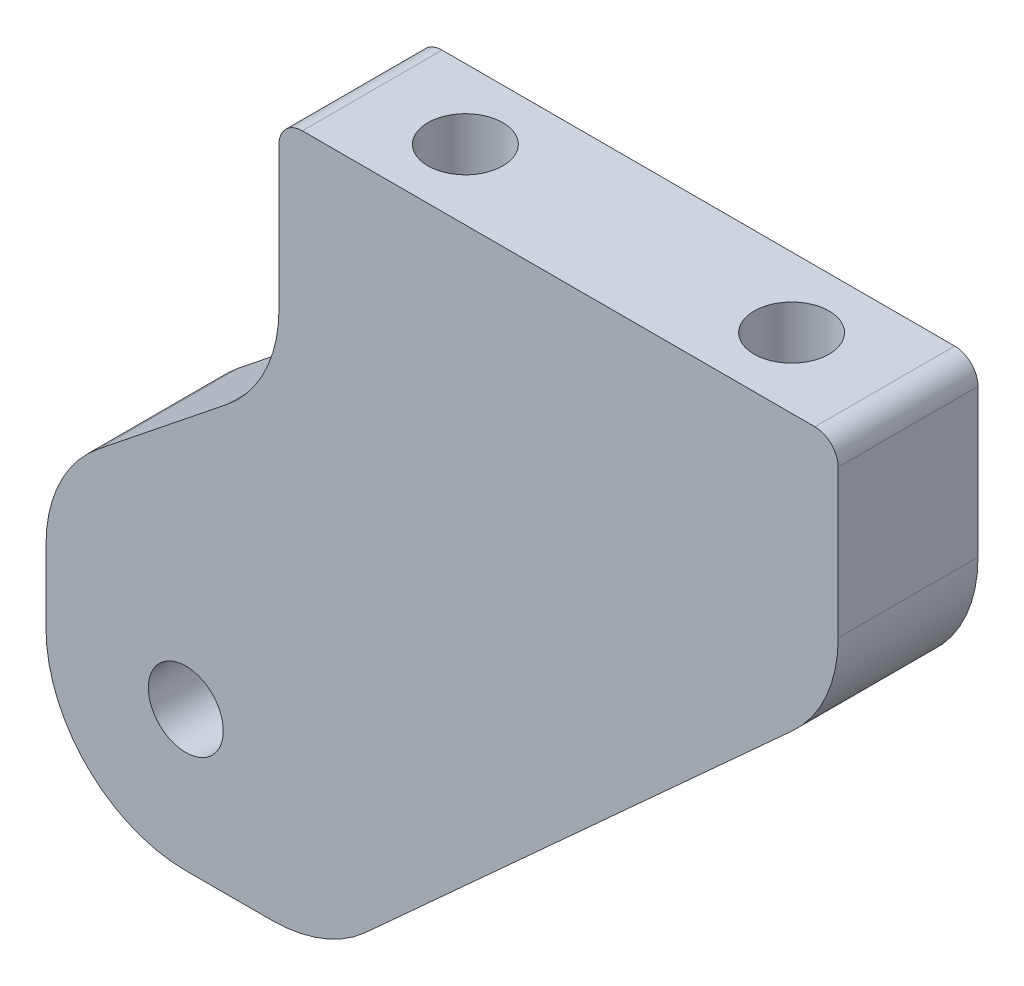
ISO-10303-21;
HEADER;
FILE_DESCRIPTION(('STEP AP214'),'2;1');
FILE_NAME('part.step','',(''),(''),'','','');
FILE_SCHEMA(('AUTOMOTIVE_DESIGN { 1 0 10303 214 1 1 1 1 }'));
ENDSEC;
DATA;
#1=APPLICATION_CONTEXT('core data for automotive mechanical design processes');
#2=APPLICATION_PROTOCOL_DEFINITION('international standard','automotive_design',2000,#1);
#3=PRODUCT_CONTEXT('',#1,'mechanical');
#4=PRODUCT('Part','Part','',(#3));
#5=PRODUCT_RELATED_PRODUCT_CATEGORY('part','',(#4));
#6=PRODUCT_DEFINITION_FORMATION('','',#4);
#7=PRODUCT_DEFINITION_CONTEXT('part definition',#1,'design');
#8=PRODUCT_DEFINITION('design','',#6,#7);
#9=PRODUCT_DEFINITION_SHAPE('','',#8);
#10=(LENGTH_UNIT() NAMED_UNIT(*) SI_UNIT(.MILLI.,.METRE.));
#11=(NAMED_UNIT(*) PLANE_ANGLE_UNIT() SI_UNIT($,.RADIAN.));
#12=(NAMED_UNIT(*) SI_UNIT($,.STERADIAN.) SOLID_ANGLE_UNIT());
#13=UNCERTAINTY_MEASURE_WITH_UNIT(LENGTH_MEASURE(1.E-05),#10,'distance_accuracy_value','');
#14=(GEOMETRIC_REPRESENTATION_CONTEXT(3) GLOBAL_UNCERTAINTY_ASSIGNED_CONTEXT((#13)) GLOBAL_UNIT_ASSIGNED_CONTEXT((#10,
#11,#12)) REPRESENTATION_CONTEXT('',''));
#15=CARTESIAN_POINT('',(0.,0.,0.));
#16=DIRECTION('',(0.,0.,1.));
#17=DIRECTION('',(1.,0.,0.));
#18=AXIS2_PLACEMENT_3D('',#15,#16,#17);
#19=CARTESIAN_POINT('',(-26.9875,-23.8125,0.));
#20=DIRECTION('',(0.,0.,-1.));
#21=DIRECTION('',(-1.,0.,0.));
#22=AXIS2_PLACEMENT_3D('',#19,#20,#21);
#23=PLANE('',#22);
#24=CARTESIAN_POINT('',(-17.4625,-14.2875000000001,0.));
#25=DIRECTION('',(0.,0.,1.));
#26=DIRECTION('',(1.,0.,0.));
#27=AXIS2_PLACEMENT_3D('',#24,#25,#26);
#28=CIRCLE('',#27,2.5527);
#29=CARTESIAN_POINT('',(-14.9098,-14.2875000000001,0.));
#30=VERTEX_POINT('',#29);
#31=EDGE_CURVE('E281',#30,#30,#28,.T.);
#32=ORIENTED_EDGE('',*,*,#31,.T.);
#33=EDGE_LOOP('',(#32));
#34=FACE_BOUND('',#33,.T.);
#35=DIRECTION('',(0.,-1.,0.));
#36=VECTOR('',#35,1.);
#37=CARTESIAN_POINT('',(-26.9875,23.8125,0.));
#38=LINE('',#37,#36);
#39=CARTESIAN_POINT('',(-26.9875,-9.34045167230957,0.));
#40=VERTEX_POINT('',#39);
#41=CARTESIAN_POINT('',(-26.9875,-14.2875,0.));
#42=VERTEX_POINT('',#41);
#43=EDGE_CURVE('E168',#40,#42,#38,.T.);
#44=ORIENTED_EDGE('',*,*,#43,.F.);
#45=CARTESIAN_POINT('',(-17.4625,-9.34045167230957,0.));
#46=DIRECTION('',(0.,0.,-1.));
#47=DIRECTION('',(-1.,0.,0.));
#48=AXIS2_PLACEMENT_3D('',#45,#46,#47);
#49=CIRCLE('',#48,9.525);
#50=CARTESIAN_POINT('',(-23.4127203279559,-1.90267626236471,0.));
#51=VERTEX_POINT('',#50);
#52=EDGE_CURVE('E235',#40,#51,#49,.T.);
#53=ORIENTED_EDGE('',*,*,#52,.T.);
#54=DIRECTION('',(0.78086880944303,0.624695047554425,0.));
#55=VECTOR('',#54,1.);
#56=CARTESIAN_POINT('',(-26.9875,-4.7625,0.));
#57=LINE('',#56,#55);
#58=CARTESIAN_POINT('',(-14.6872796720441,5.07767626236472,0.));
#59=VERTEX_POINT('',#58);
#60=EDGE_CURVE('E270',#51,#59,#57,.T.);
#61=ORIENTED_EDGE('',*,*,#60,.T.);
#62=CARTESIAN_POINT('',(-20.6375,12.5154516723096,0.));
#63=DIRECTION('',(0.,0.,-1.));
#64=DIRECTION('',(-1.,0.,0.));
#65=AXIS2_PLACEMENT_3D('',#62,#63,#64);
#66=CIRCLE('',#65,9.525);
#67=CARTESIAN_POINT('',(-11.1125,12.5154516723096,0.));
#68=VERTEX_POINT('',#67);
#69=EDGE_CURVE('E11',#59,#68,#66,.F.);
#70=ORIENTED_EDGE('',*,*,#69,.T.);
#71=DIRECTION('',(0.,1.,0.));
#72=VECTOR('',#71,1.);
#73=CARTESIAN_POINT('',(-11.1125,7.93750000000001,0.));
#74=LINE('',#73,#72);
#75=CARTESIAN_POINT('',(-11.1125,22.225,0.));
#76=VERTEX_POINT('',#75);
#77=EDGE_CURVE('E269',#68,#76,#74,.T.);
#78=ORIENTED_EDGE('',*,*,#77,.T.);
#79=CARTESIAN_POINT('',(-9.52500000000001,22.225,0.));
#80=DIRECTION('',(0.,0.,-1.));
#81=DIRECTION('',(-1.,0.,0.));
#82=AXIS2_PLACEMENT_3D('',#79,#80,#81);
#83=CIRCLE('',#82,1.5875);
#84=CARTESIAN_POINT('',(-9.52500000000001,23.8125,0.));
#85=VERTEX_POINT('',#84);
#86=EDGE_CURVE('E195',#76,#85,#83,.T.);
#87=ORIENTED_EDGE('',*,*,#86,.T.);
#88=DIRECTION('',(-1.,0.,0.));
#89=VECTOR('',#88,1.);
#90=CARTESIAN_POINT('',(26.9875,23.8125,0.));
#91=LINE('',#90,#89);
#92=CARTESIAN_POINT('',(25.4,23.8125,0.));
#93=VERTEX_POINT('',#92);
#94=EDGE_CURVE('E173',#93,#85,#91,.T.);
#95=ORIENTED_EDGE('',*,*,#94,.F.);
#96=CARTESIAN_POINT('',(25.4,22.225,0.));
#97=DIRECTION('',(0.,0.,-1.));
#98=DIRECTION('',(-1.,0.,0.));
#99=AXIS2_PLACEMENT_3D('',#96,#97,#98);
#100=CIRCLE('',#99,1.5875);
#101=CARTESIAN_POINT('',(26.9875,22.225,0.));
#102=VERTEX_POINT('',#101);
#103=EDGE_CURVE('E197',#93,#102,#100,.T.);
#104=ORIENTED_EDGE('',*,*,#103,.T.);
#105=DIRECTION('',(0.,1.,0.));
#106=VECTOR('',#105,1.);
#107=CARTESIAN_POINT('',(26.9875,23.8125,0.));
#108=LINE('',#107,#106);
#109=CARTESIAN_POINT('',(26.9875,12.1510731652917,0.));
#110=VERTEX_POINT('',#109);
#111=EDGE_CURVE('E186',#110,#102,#108,.T.);
#112=ORIENTED_EDGE('',*,*,#111,.F.);
#113=CARTESIAN_POINT('',(17.4625,12.1510731652917,0.));
#114=DIRECTION('',(0.,0.,-1.));
#115=DIRECTION('',(-1.,0.,0.));
#116=AXIS2_PLACEMENT_3D('',#113,#114,#115);
#117=CIRCLE('',#116,9.525);
#118=CARTESIAN_POINT('',(23.8697083628149,5.10314396619534,0.));
#119=VERTEX_POINT('',#118);
#120=EDGE_CURVE('E232',#110,#119,#117,.T.);
#121=ORIENTED_EDGE('',*,*,#120,.T.);
#122=DIRECTION('',(-0.739940073395944,-0.672672793996313,0.));
#123=VECTOR('',#122,1.);
#124=CARTESIAN_POINT('',(26.9875,7.93750000000001,0.));
#125=LINE('',#124,#123);
#126=CARTESIAN_POINT('',(-5.21272211900601,-21.3354291990964,0.));
#127=VERTEX_POINT('',#126);
#128=EDGE_CURVE('E284',#119,#127,#125,.T.);
#129=ORIENTED_EDGE('',*,*,#128,.T.);
#130=CARTESIAN_POINT('',(-11.6199304818209,-14.2875,0.));
#131=DIRECTION('',(0.,0.,-1.));
#132=DIRECTION('',(-1.,0.,0.));
#133=AXIS2_PLACEMENT_3D('',#130,#131,#132);
#134=CIRCLE('',#133,9.525);
#135=CARTESIAN_POINT('',(-11.6199304818209,-23.8125,0.));
#136=VERTEX_POINT('',#135);
#137=EDGE_CURVE('E53',#127,#136,#134,.T.);
#138=ORIENTED_EDGE('',*,*,#137,.T.);
#139=DIRECTION('',(1.,0.,0.));
#140=VECTOR('',#139,1.);
#141=CARTESIAN_POINT('',(26.9875,-23.8125,0.));
#142=LINE('',#141,#140);
#143=CARTESIAN_POINT('',(-17.4625,-23.8125,0.));
#144=VERTEX_POINT('',#143);
#145=EDGE_CURVE('E184',#144,#136,#142,.T.);
#146=ORIENTED_EDGE('',*,*,#145,.F.);
#147=CARTESIAN_POINT('',(-17.4625,-14.2875,0.));
#148=DIRECTION('',(0.,0.,-1.));
#149=DIRECTION('',(-1.,0.,0.));
#150=AXIS2_PLACEMENT_3D('',#147,#148,#149);
#151=CIRCLE('',#150,9.525);
#152=EDGE_CURVE('E61',#144,#42,#151,.T.);
#153=ORIENTED_EDGE('',*,*,#152,.T.);
#154=EDGE_LOOP('',(#44,#53,#61,#70,#78,#87,#95,#104,#112,#121,#129,#138,#146,#153));
#155=FACE_BOUND('',#154,.T.);
#156=ADVANCED_FACE('F38',(#34,#155),#23,.T.);
#157=CARTESIAN_POINT('',(-26.9875,23.8125,9.525));
#158=DIRECTION('',(1.,0.,0.));
#159=DIRECTION('',(0.,1.,0.));
#160=AXIS2_PLACEMENT_3D('',#157,#158,#159);
#161=PLANE('',#160);
#162=DIRECTION('',(0.,-1.,0.));
#163=VECTOR('',#162,1.);
#164=CARTESIAN_POINT('',(-26.9875,23.8125,9.525));
#165=LINE('',#164,#163);
#166=CARTESIAN_POINT('',(-26.9875,-9.34045167230957,9.525));
#167=VERTEX_POINT('',#166);
#168=CARTESIAN_POINT('',(-26.9875,-14.2875,9.525));
#169=VERTEX_POINT('',#168);
#170=EDGE_CURVE('E169',#167,#169,#165,.T.);
#171=ORIENTED_EDGE('',*,*,#170,.F.);
#172=DIRECTION('',(0.,0.,1.));
#173=VECTOR('',#172,1.);
#174=CARTESIAN_POINT('',(-26.9875,-9.34045167230957,0.));
#175=LINE('',#174,#173);
#176=EDGE_CURVE('E229',#167,#40,#175,.F.);
#177=ORIENTED_EDGE('',*,*,#176,.T.);
#178=ORIENTED_EDGE('',*,*,#43,.T.);
#179=DIRECTION('',(0.,0.,-1.));
#180=VECTOR('',#179,1.);
#181=CARTESIAN_POINT('',(-26.9875,-14.2875,9.525));
#182=LINE('',#181,#180);
#183=EDGE_CURVE('E227',#42,#169,#182,.F.);
#184=ORIENTED_EDGE('',*,*,#183,.T.);
#185=EDGE_LOOP('',(#171,#177,#178,#184));
#186=FACE_BOUND('',#185,.T.);
#187=ADVANCED_FACE('F302',(#186),#161,.F.);
#188=CARTESIAN_POINT('',(26.9875,23.8125,9.525));
#189=DIRECTION('',(0.,-1.,0.));
#190=DIRECTION('',(1.,0.,0.));
#191=AXIS2_PLACEMENT_3D('',#188,#189,#190);
#192=PLANE('',#191);
#193=CARTESIAN_POINT('',(19.05,23.8125,4.7625));
#194=DIRECTION('',(0.,1.,0.));
#195=DIRECTION('',(0.,0.,1.));
#196=AXIS2_PLACEMENT_3D('',#193,#194,#195);
#197=CIRCLE('',#196,2.55269999999999);
#198=CARTESIAN_POINT('',(19.05,23.8125,7.31519999999999));
#199=VERTEX_POINT('',#198);
#200=EDGE_CURVE('E155',#199,#199,#197,.T.);
#201=ORIENTED_EDGE('',*,*,#200,.F.);
#202=EDGE_LOOP('',(#201));
#203=FACE_BOUND('',#202,.T.);
#204=CARTESIAN_POINT('',(-3.17500000000001,23.8125,4.7625));
#205=DIRECTION('',(0.,1.,0.));
#206=DIRECTION('',(0.,0.,1.));
#207=AXIS2_PLACEMENT_3D('',#204,#205,#206);
#208=CIRCLE('',#207,2.55269999999999);
#209=CARTESIAN_POINT('',(-3.17500000000001,23.8125,7.31519999999999));
#210=VERTEX_POINT('',#209);
#211=EDGE_CURVE('E156',#210,#210,#208,.T.);
#212=ORIENTED_EDGE('',*,*,#211,.F.);
#213=EDGE_LOOP('',(#212));
#214=FACE_BOUND('',#213,.T.);
#215=DIRECTION('',(-1.,0.,0.));
#216=VECTOR('',#215,1.);
#217=CARTESIAN_POINT('',(26.9875,23.8125,9.525));
#218=LINE('',#217,#216);
#219=CARTESIAN_POINT('',(25.4,23.8125,9.525));
#220=VERTEX_POINT('',#219);
#221=CARTESIAN_POINT('',(-9.52500000000001,23.8125,9.525));
#222=VERTEX_POINT('',#221);
#223=EDGE_CURVE('E178',#220,#222,#218,.T.);
#224=ORIENTED_EDGE('',*,*,#223,.F.);
#225=DIRECTION('',(0.,0.,-1.));
#226=VECTOR('',#225,1.);
#227=CARTESIAN_POINT('',(25.4,23.8125,9.525));
#228=LINE('',#227,#226);
#229=EDGE_CURVE('E192',#220,#93,#228,.T.);
#230=ORIENTED_EDGE('',*,*,#229,.T.);
#231=ORIENTED_EDGE('',*,*,#94,.T.);
#232=DIRECTION('',(0.,0.,1.));
#233=VECTOR('',#232,1.);
#234=CARTESIAN_POINT('',(-9.52500000000001,23.8125,9.525));
#235=LINE('',#234,#233);
#236=EDGE_CURVE('E181',#85,#222,#235,.T.);
#237=ORIENTED_EDGE('',*,*,#236,.T.);
#238=EDGE_LOOP('',(#224,#230,#231,#237));
#239=FACE_BOUND('',#238,.T.);
#240=ADVANCED_FACE('F322',(#203,#214,#239),#192,.F.);
#241=CARTESIAN_POINT('',(-26.9875,-23.8125,9.525));
#242=DIRECTION('',(0.,0.,-1.));
#243=DIRECTION('',(-1.,0.,0.));
#244=AXIS2_PLACEMENT_3D('',#241,#242,#243);
#245=PLANE('',#244);
#246=CARTESIAN_POINT('',(-17.4625,-14.2875000000001,9.525));
#247=DIRECTION('',(0.,0.,1.));
#248=DIRECTION('',(1.,0.,0.));
#249=AXIS2_PLACEMENT_3D('',#246,#247,#248);
#250=CIRCLE('',#249,2.5527);
#251=CARTESIAN_POINT('',(-14.9098,-14.2875000000001,9.525));
#252=VERTEX_POINT('',#251);
#253=EDGE_CURVE('E263',#252,#252,#250,.T.);
#254=ORIENTED_EDGE('',*,*,#253,.F.);
#255=EDGE_LOOP('',(#254));
#256=FACE_BOUND('',#255,.T.);
#257=DIRECTION('',(0.78086880944303,0.624695047554425,0.));
#258=VECTOR('',#257,1.);
#259=CARTESIAN_POINT('',(-26.9875,-4.7625,9.525));
#260=LINE('',#259,#258);
#261=CARTESIAN_POINT('',(-23.4127203279559,-1.90267626236471,9.525));
#262=VERTEX_POINT('',#261);
#263=CARTESIAN_POINT('',(-14.6872796720441,5.07767626236472,9.525));
#264=VERTEX_POINT('',#263);
#265=EDGE_CURVE('E253',#262,#264,#260,.T.);
#266=ORIENTED_EDGE('',*,*,#265,.F.);
#267=CARTESIAN_POINT('',(-17.4625,-9.34045167230957,9.525));
#268=DIRECTION('',(0.,0.,-1.));
#269=DIRECTION('',(-1.,0.,0.));
#270=AXIS2_PLACEMENT_3D('',#267,#268,#269);
#271=CIRCLE('',#270,9.525);
#272=EDGE_CURVE('E225',#262,#167,#271,.F.);
#273=ORIENTED_EDGE('',*,*,#272,.T.);
#274=ORIENTED_EDGE('',*,*,#170,.T.);
#275=CARTESIAN_POINT('',(-17.4625,-14.2875,9.525));
#276=DIRECTION('',(0.,0.,-1.));
#277=DIRECTION('',(-1.,0.,0.));
#278=AXIS2_PLACEMENT_3D('',#275,#276,#277);
#279=CIRCLE('',#278,9.525);
#280=CARTESIAN_POINT('',(-17.4625,-23.8125,9.525));
#281=VERTEX_POINT('',#280);
#282=EDGE_CURVE('E223',#169,#281,#279,.F.);
#283=ORIENTED_EDGE('',*,*,#282,.T.);
#284=DIRECTION('',(1.,0.,0.));
#285=VECTOR('',#284,1.);
#286=CARTESIAN_POINT('',(26.9875,-23.8125,9.525));
#287=LINE('',#286,#285);
#288=CARTESIAN_POINT('',(-11.6199304818209,-23.8125,9.525));
#289=VERTEX_POINT('',#288);
#290=EDGE_CURVE('E172',#281,#289,#287,.T.);
#291=ORIENTED_EDGE('',*,*,#290,.T.);
#292=CARTESIAN_POINT('',(-11.6199304818209,-14.2875,9.525));
#293=DIRECTION('',(0.,0.,-1.));
#294=DIRECTION('',(-1.,0.,0.));
#295=AXIS2_PLACEMENT_3D('',#292,#293,#294);
#296=CIRCLE('',#295,9.525);
#297=CARTESIAN_POINT('',(-5.212722119006,-21.3354291990964,9.525));
#298=VERTEX_POINT('',#297);
#299=EDGE_CURVE('E219',#289,#298,#296,.F.);
#300=ORIENTED_EDGE('',*,*,#299,.T.);
#301=DIRECTION('',(-0.739940073395944,-0.672672793996313,0.));
#302=VECTOR('',#301,1.);
#303=CARTESIAN_POINT('',(26.9875,7.93750000000001,9.525));
#304=LINE('',#303,#302);
#305=CARTESIAN_POINT('',(23.8697083628149,5.10314396619534,9.525));
#306=VERTEX_POINT('',#305);
#307=EDGE_CURVE('E162',#306,#298,#304,.T.);
#308=ORIENTED_EDGE('',*,*,#307,.F.);
#309=CARTESIAN_POINT('',(17.4625,12.1510731652917,9.525));
#310=DIRECTION('',(0.,0.,-1.));
#311=DIRECTION('',(-1.,0.,0.));
#312=AXIS2_PLACEMENT_3D('',#309,#310,#311);
#313=CIRCLE('',#312,9.525);
#314=CARTESIAN_POINT('',(26.9875,12.1510731652917,9.525));
#315=VERTEX_POINT('',#314);
#316=EDGE_CURVE('E221',#306,#315,#313,.F.);
#317=ORIENTED_EDGE('',*,*,#316,.T.);
#318=DIRECTION('',(0.,1.,0.));
#319=VECTOR('',#318,1.);
#320=CARTESIAN_POINT('',(26.9875,23.8125,9.525));
#321=LINE('',#320,#319);
#322=CARTESIAN_POINT('',(26.9875,22.225,9.525));
#323=VERTEX_POINT('',#322);
#324=EDGE_CURVE('E176',#315,#323,#321,.T.);
#325=ORIENTED_EDGE('',*,*,#324,.T.);
#326=CARTESIAN_POINT('',(25.4,22.225,9.525));
#327=DIRECTION('',(0.,0.,-1.));
#328=DIRECTION('',(-1.,0.,0.));
#329=AXIS2_PLACEMENT_3D('',#326,#327,#328);
#330=CIRCLE('',#329,1.5875);
#331=EDGE_CURVE('E206',#323,#220,#330,.F.);
#332=ORIENTED_EDGE('',*,*,#331,.T.);
#333=ORIENTED_EDGE('',*,*,#223,.T.);
#334=CARTESIAN_POINT('',(-9.52500000000001,22.225,9.525));
#335=DIRECTION('',(0.,0.,-1.));
#336=DIRECTION('',(-1.,0.,0.));
#337=AXIS2_PLACEMENT_3D('',#334,#335,#336);
#338=CIRCLE('',#337,1.5875);
#339=CARTESIAN_POINT('',(-11.1125,22.225,9.525));
#340=VERTEX_POINT('',#339);
#341=EDGE_CURVE('E203',#222,#340,#338,.F.);
#342=ORIENTED_EDGE('',*,*,#341,.T.);
#343=DIRECTION('',(0.,1.,0.));
#344=VECTOR('',#343,1.);
#345=CARTESIAN_POINT('',(-11.1125,-23.8125,9.525));
#346=LINE('',#345,#344);
#347=CARTESIAN_POINT('',(-11.1125,12.5154516723096,9.525));
#348=VERTEX_POINT('',#347);
#349=EDGE_CURVE('E254',#348,#340,#346,.T.);
#350=ORIENTED_EDGE('',*,*,#349,.F.);
#351=CARTESIAN_POINT('',(-20.6375,12.5154516723096,9.525));
#352=DIRECTION('',(0.,0.,-1.));
#353=DIRECTION('',(-1.,0.,0.));
#354=AXIS2_PLACEMENT_3D('',#351,#352,#353);
#355=CIRCLE('',#354,9.525);
#356=EDGE_CURVE('E46',#348,#264,#355,.T.);
#357=ORIENTED_EDGE('',*,*,#356,.T.);
#358=EDGE_LOOP('',(#266,#273,#274,#283,#291,#300,#308,#317,#325,#332,#333,#342,#350,#357));
#359=FACE_BOUND('',#358,.T.);
#360=ADVANCED_FACE('F252',(#256,#359),#245,.F.);
#361=CARTESIAN_POINT('',(26.9875,-23.8125,9.525));
#362=DIRECTION('',(0.,1.,0.));
#363=DIRECTION('',(-1.,0.,0.));
#364=AXIS2_PLACEMENT_3D('',#361,#362,#363);
#365=PLANE('',#364);
#366=ORIENTED_EDGE('',*,*,#290,.F.);
#367=DIRECTION('',(0.,0.,-1.));
#368=VECTOR('',#367,1.);
#369=CARTESIAN_POINT('',(-17.4625,-23.8125,9.525));
#370=LINE('',#369,#368);
#371=EDGE_CURVE('E240',#281,#144,#370,.T.);
#372=ORIENTED_EDGE('',*,*,#371,.T.);
#373=ORIENTED_EDGE('',*,*,#145,.T.);
#374=DIRECTION('',(0.,0.,1.));
#375=VECTOR('',#374,1.);
#376=CARTESIAN_POINT('',(-11.6199304818209,-23.8125,9.525));
#377=LINE('',#376,#375);
#378=EDGE_CURVE('E237',#136,#289,#377,.T.);
#379=ORIENTED_EDGE('',*,*,#378,.T.);
#380=EDGE_LOOP('',(#366,#372,#373,#379));
#381=FACE_BOUND('',#380,.T.);
#382=ADVANCED_FACE('F296',(#381),#365,.F.);
#383=CARTESIAN_POINT('',(26.9875,23.8125,9.525));
#384=DIRECTION('',(-1.,0.,0.));
#385=DIRECTION('',(0.,-1.,0.));
#386=AXIS2_PLACEMENT_3D('',#383,#384,#385);
#387=PLANE('',#386);
#388=ORIENTED_EDGE('',*,*,#324,.F.);
#389=DIRECTION('',(0.,0.,1.));
#390=VECTOR('',#389,1.);
#391=CARTESIAN_POINT('',(26.9875,12.1510731652917,9.525));
#392=LINE('',#391,#390);
#393=EDGE_CURVE('E247',#315,#110,#392,.F.);
#394=ORIENTED_EDGE('',*,*,#393,.T.);
#395=ORIENTED_EDGE('',*,*,#111,.T.);
#396=DIRECTION('',(0.,0.,-1.));
#397=VECTOR('',#396,1.);
#398=CARTESIAN_POINT('',(26.9875,22.225,9.525));
#399=LINE('',#398,#397);
#400=EDGE_CURVE('E200',#102,#323,#399,.F.);
#401=ORIENTED_EDGE('',*,*,#400,.T.);
#402=EDGE_LOOP('',(#388,#394,#395,#401));
#403=FACE_BOUND('',#402,.T.);
#404=ADVANCED_FACE('F330',(#403),#387,.F.);
#405=CARTESIAN_POINT('',(19.05,4.76250000000001,4.7625));
#406=DIRECTION('',(0.,1.,0.));
#407=DIRECTION('',(0.,0.,1.));
#408=AXIS2_PLACEMENT_3D('',#405,#406,#407);
#409=CONICAL_SURFACE('',#408,2.5527,1.02974425867665);
#410=CARTESIAN_POINT('',(19.05,3.22868309780836,4.7625));
#411=VERTEX_POINT('',#410);
#412=VERTEX_LOOP('',#411);
#413=FACE_BOUND('',#412,.T.);
#414=CARTESIAN_POINT('',(19.05,4.76250000000001,4.7625));
#415=DIRECTION('',(0.,1.,0.));
#416=DIRECTION('',(0.,0.,1.));
#417=AXIS2_PLACEMENT_3D('',#414,#415,#416);
#418=CIRCLE('',#417,2.5527);
#419=CARTESIAN_POINT('',(19.05,4.76250000000001,7.3152));
#420=VERTEX_POINT('',#419);
#421=EDGE_CURVE('E159',#420,#420,#418,.T.);
#422=ORIENTED_EDGE('',*,*,#421,.T.);
#423=EDGE_LOOP('',(#422));
#424=FACE_BOUND('',#423,.T.);
#425=ADVANCED_FACE('F333',(#413,#424),#409,.F.);
#426=CARTESIAN_POINT('',(19.05,23.8125,4.7625));
#427=DIRECTION('',(0.,1.,0.));
#428=DIRECTION('',(0.,0.,1.));
#429=AXIS2_PLACEMENT_3D('',#426,#427,#428);
#430=CYLINDRICAL_SURFACE('',#429,2.55269999999999);
#431=ORIENTED_EDGE('',*,*,#421,.F.);
#432=EDGE_LOOP('',(#431));
#433=FACE_BOUND('',#432,.T.);
#434=ORIENTED_EDGE('',*,*,#200,.T.);
#435=EDGE_LOOP('',(#434));
#436=FACE_BOUND('',#435,.T.);
#437=ADVANCED_FACE('F149',(#433,#436),#430,.F.);
#438=CARTESIAN_POINT('',(-3.17500000000001,4.76250000000001,4.7625));
#439=DIRECTION('',(0.,1.,0.));
#440=DIRECTION('',(0.,0.,1.));
#441=AXIS2_PLACEMENT_3D('',#438,#439,#440);
#442=CONICAL_SURFACE('',#441,2.5527,1.02974425867665);
#443=CARTESIAN_POINT('',(-3.17500000000002,3.22868309780835,4.7625));
#444=VERTEX_POINT('',#443);
#445=VERTEX_LOOP('',#444);
#446=FACE_BOUND('',#445,.T.);
#447=CARTESIAN_POINT('',(-3.17500000000001,4.76250000000001,4.7625));
#448=DIRECTION('',(0.,1.,0.));
#449=DIRECTION('',(0.,0.,1.));
#450=AXIS2_PLACEMENT_3D('',#447,#448,#449);
#451=CIRCLE('',#450,2.5527);
#452=CARTESIAN_POINT('',(-3.17500000000001,4.76250000000001,7.3152));
#453=VERTEX_POINT('',#452);
#454=EDGE_CURVE('E153',#453,#453,#451,.T.);
#455=ORIENTED_EDGE('',*,*,#454,.T.);
#456=EDGE_LOOP('',(#455));
#457=FACE_BOUND('',#456,.T.);
#458=ADVANCED_FACE('F145',(#446,#457),#442,.F.);
#459=CARTESIAN_POINT('',(-3.17500000000001,23.8125,4.7625));
#460=DIRECTION('',(0.,1.,0.));
#461=DIRECTION('',(0.,0.,1.));
#462=AXIS2_PLACEMENT_3D('',#459,#460,#461);
#463=CYLINDRICAL_SURFACE('',#462,2.55269999999999);
#464=ORIENTED_EDGE('',*,*,#454,.F.);
#465=EDGE_LOOP('',(#464));
#466=FACE_BOUND('',#465,.T.);
#467=ORIENTED_EDGE('',*,*,#211,.T.);
#468=EDGE_LOOP('',(#467));
#469=FACE_BOUND('',#468,.T.);
#470=ADVANCED_FACE('F148',(#466,#469),#463,.F.);
#471=CARTESIAN_POINT('',(26.9875,7.93750000000001,-0.000999999999999265));
#472=DIRECTION('',(-0.672672793996313,0.739940073395944,0.));
#473=DIRECTION('',(-0.739940073395944,-0.672672793996313,0.));
#474=AXIS2_PLACEMENT_3D('',#471,#472,#473);
#475=PLANE('',#474);
#476=ORIENTED_EDGE('',*,*,#128,.F.);
#477=DIRECTION('',(0.,0.,1.));
#478=VECTOR('',#477,1.);
#479=CARTESIAN_POINT('',(23.8697083628149,5.10314396619534,-0.000999999999999265));
#480=LINE('',#479,#478);
#481=EDGE_CURVE('E244',#119,#306,#480,.T.);
#482=ORIENTED_EDGE('',*,*,#481,.T.);
#483=ORIENTED_EDGE('',*,*,#307,.T.);
#484=DIRECTION('',(0.,0.,1.));
#485=VECTOR('',#484,1.);
#486=CARTESIAN_POINT('',(-5.212722119006,-21.3354291990964,-0.000999999999999265));
#487=LINE('',#486,#485);
#488=EDGE_CURVE('E242',#298,#127,#487,.F.);
#489=ORIENTED_EDGE('',*,*,#488,.T.);
#490=EDGE_LOOP('',(#476,#482,#483,#489));
#491=FACE_BOUND('',#490,.T.);
#492=ADVANCED_FACE('F290',(#491),#475,.F.);
#493=CARTESIAN_POINT('',(-17.4625,-14.2875000000001,9.525));
#494=DIRECTION('',(0.,0.,1.));
#495=DIRECTION('',(1.,0.,0.));
#496=AXIS2_PLACEMENT_3D('',#493,#494,#495);
#497=CYLINDRICAL_SURFACE('',#496,2.5527);
#498=ORIENTED_EDGE('',*,*,#31,.F.);
#499=EDGE_LOOP('',(#498));
#500=FACE_BOUND('',#499,.T.);
#501=ORIENTED_EDGE('',*,*,#253,.T.);
#502=EDGE_LOOP('',(#501));
#503=FACE_BOUND('',#502,.T.);
#504=ADVANCED_FACE('F403',(#500,#503),#497,.F.);
#505=CARTESIAN_POINT('',(-26.9875,-4.7625,0.));
#506=DIRECTION('',(-0.624695047554425,0.78086880944303,0.));
#507=DIRECTION('',(0.78086880944303,0.624695047554425,0.));
#508=AXIS2_PLACEMENT_3D('',#505,#506,#507);
#509=PLANE('',#508);
#510=ORIENTED_EDGE('',*,*,#265,.T.);
#511=DIRECTION('',(0.,0.,1.));
#512=VECTOR('',#511,1.);
#513=CARTESIAN_POINT('',(-14.6872796720441,5.07767626236472,0.));
#514=LINE('',#513,#512);
#515=EDGE_CURVE('E217',#264,#59,#514,.F.);
#516=ORIENTED_EDGE('',*,*,#515,.T.);
#517=ORIENTED_EDGE('',*,*,#60,.F.);
#518=DIRECTION('',(0.,0.,1.));
#519=VECTOR('',#518,1.);
#520=CARTESIAN_POINT('',(-23.4127203279559,-1.90267626236471,9.525));
#521=LINE('',#520,#519);
#522=EDGE_CURVE('E214',#51,#262,#521,.T.);
#523=ORIENTED_EDGE('',*,*,#522,.T.);
#524=EDGE_LOOP('',(#510,#516,#517,#523));
#525=FACE_BOUND('',#524,.T.);
#526=ADVANCED_FACE('F259',(#525),#509,.T.);
#527=CARTESIAN_POINT('',(-11.1125,7.93750000000001,0.));
#528=DIRECTION('',(-1.,0.,0.));
#529=DIRECTION('',(0.,1.,0.));
#530=AXIS2_PLACEMENT_3D('',#527,#528,#529);
#531=PLANE('',#530);
#532=ORIENTED_EDGE('',*,*,#77,.F.);
#533=DIRECTION('',(0.,0.,1.));
#534=VECTOR('',#533,1.);
#535=CARTESIAN_POINT('',(-11.1125,12.5154516723096,9.525));
#536=LINE('',#535,#534);
#537=EDGE_CURVE('E211',#68,#348,#536,.T.);
#538=ORIENTED_EDGE('',*,*,#537,.T.);
#539=ORIENTED_EDGE('',*,*,#349,.T.);
#540=DIRECTION('',(0.,0.,1.));
#541=VECTOR('',#540,1.);
#542=CARTESIAN_POINT('',(-11.1125,22.225,0.));
#543=LINE('',#542,#541);
#544=EDGE_CURVE('E208',#340,#76,#543,.F.);
#545=ORIENTED_EDGE('',*,*,#544,.T.);
#546=EDGE_LOOP('',(#532,#538,#539,#545));
#547=FACE_BOUND('',#546,.T.);
#548=ADVANCED_FACE('F272',(#547),#531,.T.);
#549=CARTESIAN_POINT('',(25.4,22.225,9.525));
#550=DIRECTION('',(0.,0.,-1.));
#551=DIRECTION('',(-1.,0.,0.));
#552=AXIS2_PLACEMENT_3D('',#549,#550,#551);
#553=CYLINDRICAL_SURFACE('',#552,1.5875);
#554=ORIENTED_EDGE('',*,*,#331,.F.);
#555=ORIENTED_EDGE('',*,*,#400,.F.);
#556=ORIENTED_EDGE('',*,*,#103,.F.);
#557=ORIENTED_EDGE('',*,*,#229,.F.);
#558=EDGE_LOOP('',(#554,#555,#556,#557));
#559=FACE_BOUND('',#558,.T.);
#560=ADVANCED_FACE('F337',(#559),#553,.T.);
#561=CARTESIAN_POINT('',(-9.52500000000001,22.225,9.525));
#562=DIRECTION('',(0.,0.,-1.));
#563=DIRECTION('',(-1.,0.,0.));
#564=AXIS2_PLACEMENT_3D('',#561,#562,#563);
#565=CYLINDRICAL_SURFACE('',#564,1.5875);
#566=ORIENTED_EDGE('',*,*,#86,.F.);
#567=ORIENTED_EDGE('',*,*,#544,.F.);
#568=ORIENTED_EDGE('',*,*,#341,.F.);
#569=ORIENTED_EDGE('',*,*,#236,.F.);
#570=EDGE_LOOP('',(#566,#567,#568,#569));
#571=FACE_BOUND('',#570,.T.);
#572=ADVANCED_FACE('F314',(#571),#565,.T.);
#573=CARTESIAN_POINT('',(-20.6375,12.5154516723096,0.));
#574=DIRECTION('',(0.,0.,-1.));
#575=DIRECTION('',(-1.,0.,0.));
#576=AXIS2_PLACEMENT_3D('',#573,#574,#575);
#577=CYLINDRICAL_SURFACE('',#576,9.525);
#578=ORIENTED_EDGE('',*,*,#69,.F.);
#579=ORIENTED_EDGE('',*,*,#515,.F.);
#580=ORIENTED_EDGE('',*,*,#356,.F.);
#581=ORIENTED_EDGE('',*,*,#537,.F.);
#582=EDGE_LOOP('',(#578,#579,#580,#581));
#583=FACE_BOUND('',#582,.T.);
#584=ADVANCED_FACE('F266',(#583),#577,.F.);
#585=CARTESIAN_POINT('',(-17.4625,-9.34045167230957,0.));
#586=DIRECTION('',(0.,0.,-1.));
#587=DIRECTION('',(-1.,0.,0.));
#588=AXIS2_PLACEMENT_3D('',#585,#586,#587);
#589=CYLINDRICAL_SURFACE('',#588,9.525);
#590=ORIENTED_EDGE('',*,*,#52,.F.);
#591=ORIENTED_EDGE('',*,*,#176,.F.);
#592=ORIENTED_EDGE('',*,*,#272,.F.);
#593=ORIENTED_EDGE('',*,*,#522,.F.);
#594=EDGE_LOOP('',(#590,#591,#592,#593));
#595=FACE_BOUND('',#594,.T.);
#596=ADVANCED_FACE('F305',(#595),#589,.T.);
#597=CARTESIAN_POINT('',(-17.4625,-14.2875,9.525));
#598=DIRECTION('',(0.,0.,-1.));
#599=DIRECTION('',(-1.,0.,0.));
#600=AXIS2_PLACEMENT_3D('',#597,#598,#599);
#601=CYLINDRICAL_SURFACE('',#600,9.525);
#602=ORIENTED_EDGE('',*,*,#282,.F.);
#603=ORIENTED_EDGE('',*,*,#183,.F.);
#604=ORIENTED_EDGE('',*,*,#152,.F.);
#605=ORIENTED_EDGE('',*,*,#371,.F.);
#606=EDGE_LOOP('',(#602,#603,#604,#605));
#607=FACE_BOUND('',#606,.T.);
#608=ADVANCED_FACE('F299',(#607),#601,.T.);
#609=CARTESIAN_POINT('',(17.4625,12.1510731652917,-0.000999999999999265));
#610=DIRECTION('',(0.,0.,1.));
#611=DIRECTION('',(1.,0.,0.));
#612=AXIS2_PLACEMENT_3D('',#609,#610,#611);
#613=CYLINDRICAL_SURFACE('',#612,9.525);
#614=ORIENTED_EDGE('',*,*,#120,.F.);
#615=ORIENTED_EDGE('',*,*,#393,.F.);
#616=ORIENTED_EDGE('',*,*,#316,.F.);
#617=ORIENTED_EDGE('',*,*,#481,.F.);
#618=EDGE_LOOP('',(#614,#615,#616,#617));
#619=FACE_BOUND('',#618,.T.);
#620=ADVANCED_FACE('F312',(#619),#613,.T.);
#621=CARTESIAN_POINT('',(-11.6199304818209,-14.2875,9.525));
#622=DIRECTION('',(0.,0.,1.));
#623=DIRECTION('',(1.,0.,0.));
#624=AXIS2_PLACEMENT_3D('',#621,#622,#623);
#625=CYLINDRICAL_SURFACE('',#624,9.525);
#626=ORIENTED_EDGE('',*,*,#137,.F.);
#627=ORIENTED_EDGE('',*,*,#488,.F.);
#628=ORIENTED_EDGE('',*,*,#299,.F.);
#629=ORIENTED_EDGE('',*,*,#378,.F.);
#630=EDGE_LOOP('',(#626,#627,#628,#629));
#631=FACE_BOUND('',#630,.T.);
#632=ADVANCED_FACE('F40',(#631),#625,.T.);
#633=CLOSED_SHELL('',(#156,#187,#240,#360,#382,#404,#425,#437,#458,#470,#492,#504,#526,#548,
#560,#572,#584,#596,#608,#620,#632));
#634=MANIFOLD_SOLID_BREP('B2',#633);
#635=ADVANCED_BREP_SHAPE_REPRESENTATION('',(#18,#634),#14);
#636=SHAPE_DEFINITION_REPRESENTATION(#9,#635);
ENDSEC;
END-ISO-10303-21;
